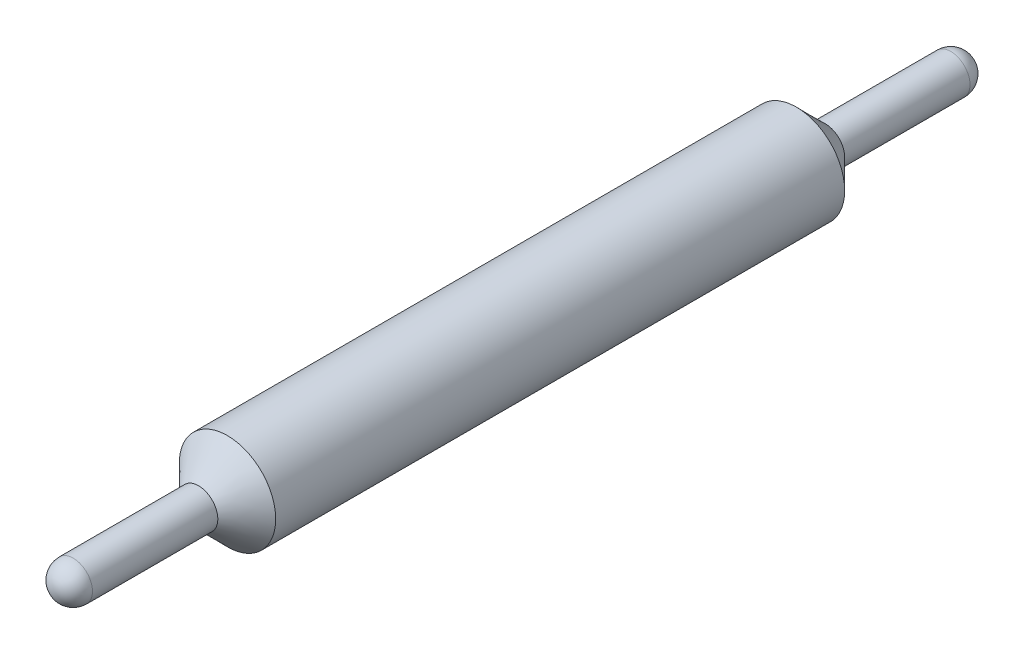
ISO-10303-21;
HEADER;
FILE_DESCRIPTION(('STEP AP214'),'2;1');
FILE_NAME('part.step','',(''),(''),'','','');
FILE_SCHEMA(('AUTOMOTIVE_DESIGN { 1 0 10303 214 1 1 1 1 }'));
ENDSEC;
DATA;
#1=APPLICATION_CONTEXT('core data for automotive mechanical design processes');
#2=APPLICATION_PROTOCOL_DEFINITION('international standard','automotive_design',2000,#1);
#3=PRODUCT_CONTEXT('',#1,'mechanical');
#4=PRODUCT('Part','Part','',(#3));
#5=PRODUCT_RELATED_PRODUCT_CATEGORY('part','',(#4));
#6=PRODUCT_DEFINITION_FORMATION('','',#4);
#7=PRODUCT_DEFINITION_CONTEXT('part definition',#1,'design');
#8=PRODUCT_DEFINITION('design','',#6,#7);
#9=PRODUCT_DEFINITION_SHAPE('','',#8);
#10=(LENGTH_UNIT() NAMED_UNIT(*) SI_UNIT(.MILLI.,.METRE.));
#11=(NAMED_UNIT(*) PLANE_ANGLE_UNIT() SI_UNIT($,.RADIAN.));
#12=(NAMED_UNIT(*) SI_UNIT($,.STERADIAN.) SOLID_ANGLE_UNIT());
#13=UNCERTAINTY_MEASURE_WITH_UNIT(LENGTH_MEASURE(1.E-05),#10,'distance_accuracy_value','');
#14=(GEOMETRIC_REPRESENTATION_CONTEXT(3) GLOBAL_UNCERTAINTY_ASSIGNED_CONTEXT((#13)) GLOBAL_UNIT_ASSIGNED_CONTEXT((#10,
#11,#12)) REPRESENTATION_CONTEXT('',''));
#15=CARTESIAN_POINT('',(0.,0.,0.));
#16=DIRECTION('',(0.,0.,1.));
#17=DIRECTION('',(1.,0.,0.));
#18=AXIS2_PLACEMENT_3D('',#15,#16,#17);
#19=CARTESIAN_POINT('',(0.,0.,3.25));
#20=DIRECTION('',(0.,0.,-1.));
#21=DIRECTION('',(-1.,0.,0.));
#22=AXIS2_PLACEMENT_3D('',#19,#20,#21);
#23=CYLINDRICAL_SURFACE('',#22,0.25);
#24=CARTESIAN_POINT('',(0.,0.,3.1));
#25=DIRECTION('',(0.,0.,1.));
#26=DIRECTION('',(1.,0.,0.));
#27=AXIS2_PLACEMENT_3D('',#24,#25,#26);
#28=CIRCLE('',#27,0.25);
#29=CARTESIAN_POINT('',(0.25,0.,3.1));
#30=VERTEX_POINT('',#29);
#31=EDGE_CURVE('E10',#30,#30,#28,.F.);
#32=ORIENTED_EDGE('',*,*,#31,.T.);
#33=EDGE_LOOP('',(#32));
#34=FACE_BOUND('',#33,.T.);
#35=CARTESIAN_POINT('',(0.,0.,0.150000000000002));
#36=DIRECTION('',(0.,0.,1.));
#37=DIRECTION('',(1.,0.,0.));
#38=AXIS2_PLACEMENT_3D('',#35,#36,#37);
#39=CIRCLE('',#38,0.25);
#40=CARTESIAN_POINT('',(0.25,0.,0.150000000000002));
#41=VERTEX_POINT('',#40);
#42=EDGE_CURVE('E43',#41,#41,#39,.T.);
#43=ORIENTED_EDGE('',*,*,#42,.T.);
#44=EDGE_LOOP('',(#43));
#45=FACE_BOUND('',#44,.T.);
#46=ADVANCED_FACE('F36',(#34,#45),#23,.T.);
#47=CARTESIAN_POINT('',(0.,0.,-0.65));
#48=DIRECTION('',(0.,0.,1.));
#49=DIRECTION('',(1.,0.,0.));
#50=AXIS2_PLACEMENT_3D('',#47,#48,#49);
#51=CYLINDRICAL_SURFACE('',#50,0.1);
#52=CARTESIAN_POINT('',(0.,0.,-0.65));
#53=DIRECTION('',(0.,0.,-1.));
#54=DIRECTION('',(-1.,0.,0.));
#55=AXIS2_PLACEMENT_3D('',#52,#53,#54);
#56=CIRCLE('',#55,0.1);
#57=CARTESIAN_POINT('',(-0.1,0.,-0.65));
#58=VERTEX_POINT('',#57);
#59=EDGE_CURVE('E51',#58,#58,#56,.T.);
#60=ORIENTED_EDGE('',*,*,#59,.F.);
#61=EDGE_LOOP('',(#60));
#62=FACE_BOUND('',#61,.T.);
#63=CARTESIAN_POINT('',(0.,0.,0.));
#64=DIRECTION('',(0.,0.,1.));
#65=DIRECTION('',(1.,0.,0.));
#66=AXIS2_PLACEMENT_3D('',#63,#64,#65);
#67=CIRCLE('',#66,0.1);
#68=CARTESIAN_POINT('',(0.1,0.,0.));
#69=VERTEX_POINT('',#68);
#70=EDGE_CURVE('E47',#69,#69,#67,.F.);
#71=ORIENTED_EDGE('',*,*,#70,.T.);
#72=EDGE_LOOP('',(#71));
#73=FACE_BOUND('',#72,.T.);
#74=ADVANCED_FACE('F77',(#62,#73),#51,.T.);
#75=CARTESIAN_POINT('',(0.,0.,-0.65));
#76=DIRECTION('',(0.,0.,1.));
#77=DIRECTION('',(1.,0.,0.));
#78=AXIS2_PLACEMENT_3D('',#75,#76,#77);
#79=SPHERICAL_SURFACE('',#78,0.1);
#80=ORIENTED_EDGE('',*,*,#59,.T.);
#81=EDGE_LOOP('',(#80));
#82=FACE_BOUND('',#81,.T.);
#83=ADVANCED_FACE('F82',(#82),#79,.T.);
#84=CARTESIAN_POINT('',(0.,0.,3.9));
#85=DIRECTION('',(0.,0.,-1.));
#86=DIRECTION('',(-1.,0.,0.));
#87=AXIS2_PLACEMENT_3D('',#84,#85,#86);
#88=CYLINDRICAL_SURFACE('',#87,0.1);
#89=CARTESIAN_POINT('',(0.,0.,3.9));
#90=DIRECTION('',(0.,0.,1.));
#91=DIRECTION('',(1.,0.,0.));
#92=AXIS2_PLACEMENT_3D('',#89,#90,#91);
#93=CIRCLE('',#92,0.1);
#94=CARTESIAN_POINT('',(0.1,0.,3.9));
#95=VERTEX_POINT('',#94);
#96=EDGE_CURVE('E54',#95,#95,#93,.T.);
#97=ORIENTED_EDGE('',*,*,#96,.F.);
#98=EDGE_LOOP('',(#97));
#99=FACE_BOUND('',#98,.T.);
#100=CARTESIAN_POINT('',(0.,0.,3.25));
#101=DIRECTION('',(0.,0.,1.));
#102=DIRECTION('',(1.,0.,0.));
#103=AXIS2_PLACEMENT_3D('',#100,#101,#102);
#104=CIRCLE('',#103,0.1);
#105=CARTESIAN_POINT('',(0.1,0.,3.25));
#106=VERTEX_POINT('',#105);
#107=EDGE_CURVE('E57',#106,#106,#104,.T.);
#108=ORIENTED_EDGE('',*,*,#107,.T.);
#109=EDGE_LOOP('',(#108));
#110=FACE_BOUND('',#109,.T.);
#111=ADVANCED_FACE('F63',(#99,#110),#88,.T.);
#112=CARTESIAN_POINT('',(0.,0.,3.9));
#113=DIRECTION('',(0.,0.,1.));
#114=DIRECTION('',(1.,0.,0.));
#115=AXIS2_PLACEMENT_3D('',#112,#113,#114);
#116=SPHERICAL_SURFACE('',#115,0.1);
#117=ORIENTED_EDGE('',*,*,#96,.T.);
#118=EDGE_LOOP('',(#117));
#119=FACE_BOUND('',#118,.T.);
#120=ADVANCED_FACE('F67',(#119),#116,.T.);
#121=CARTESIAN_POINT('',(0.,0.,3.25));
#122=DIRECTION('',(0.,0.,-1.));
#123=DIRECTION('',(-1.,0.,0.));
#124=AXIS2_PLACEMENT_3D('',#121,#122,#123);
#125=CONICAL_SURFACE('',#124,0.100000000000002,0.785398163397447);
#126=ORIENTED_EDGE('',*,*,#31,.F.);
#127=EDGE_LOOP('',(#126));
#128=FACE_BOUND('',#127,.T.);
#129=ORIENTED_EDGE('',*,*,#107,.F.);
#130=EDGE_LOOP('',(#129));
#131=FACE_BOUND('',#130,.T.);
#132=ADVANCED_FACE('F65',(#128,#131),#125,.T.);
#133=CARTESIAN_POINT('',(0.,0.,0.150000000000002));
#134=DIRECTION('',(0.,0.,1.));
#135=DIRECTION('',(1.,0.,0.));
#136=AXIS2_PLACEMENT_3D('',#133,#134,#135);
#137=CONICAL_SURFACE('',#136,0.25,0.785398163397453);
#138=ORIENTED_EDGE('',*,*,#70,.F.);
#139=EDGE_LOOP('',(#138));
#140=FACE_BOUND('',#139,.T.);
#141=ORIENTED_EDGE('',*,*,#42,.F.);
#142=EDGE_LOOP('',(#141));
#143=FACE_BOUND('',#142,.T.);
#144=ADVANCED_FACE('F38',(#140,#143),#137,.T.);
#145=CLOSED_SHELL('',(#46,#74,#83,#111,#120,#132,#144));
#146=MANIFOLD_SOLID_BREP('B2',#145);
#147=ADVANCED_BREP_SHAPE_REPRESENTATION('',(#18,#146),#14);
#148=SHAPE_DEFINITION_REPRESENTATION(#9,#147);
ENDSEC;
END-ISO-10303-21;
